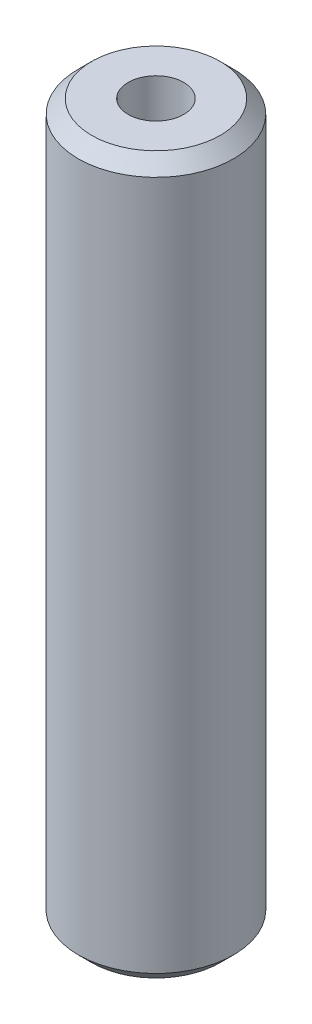
ISO-10303-21;
HEADER;
FILE_DESCRIPTION(('STEP AP214'),'2;1');
FILE_NAME('part.step','',(''),(''),'','','');
FILE_SCHEMA(('AUTOMOTIVE_DESIGN { 1 0 10303 214 1 1 1 1 }'));
ENDSEC;
DATA;
#1=APPLICATION_CONTEXT('core data for automotive mechanical design processes');
#2=APPLICATION_PROTOCOL_DEFINITION('international standard','automotive_design',2000,#1);
#3=PRODUCT_CONTEXT('',#1,'mechanical');
#4=PRODUCT('Part','Part','',(#3));
#5=PRODUCT_RELATED_PRODUCT_CATEGORY('part','',(#4));
#6=PRODUCT_DEFINITION_FORMATION('','',#4);
#7=PRODUCT_DEFINITION_CONTEXT('part definition',#1,'design');
#8=PRODUCT_DEFINITION('design','',#6,#7);
#9=PRODUCT_DEFINITION_SHAPE('','',#8);
#10=(LENGTH_UNIT() NAMED_UNIT(*) SI_UNIT(.MILLI.,.METRE.));
#11=(NAMED_UNIT(*) PLANE_ANGLE_UNIT() SI_UNIT($,.RADIAN.));
#12=(NAMED_UNIT(*) SI_UNIT($,.STERADIAN.) SOLID_ANGLE_UNIT());
#13=UNCERTAINTY_MEASURE_WITH_UNIT(LENGTH_MEASURE(1.E-05),#10,'distance_accuracy_value','');
#14=(GEOMETRIC_REPRESENTATION_CONTEXT(3) GLOBAL_UNCERTAINTY_ASSIGNED_CONTEXT((#13)) GLOBAL_UNIT_ASSIGNED_CONTEXT((#10,
#11,#12)) REPRESENTATION_CONTEXT('',''));
#15=CARTESIAN_POINT('',(0.,0.,0.));
#16=DIRECTION('',(0.,0.,1.));
#17=DIRECTION('',(1.,0.,0.));
#18=AXIS2_PLACEMENT_3D('',#15,#16,#17);
#19=CARTESIAN_POINT('',(0.,253.677838348339,0.));
#20=DIRECTION('',(0.,-1.,0.));
#21=DIRECTION('',(0.,0.,-1.));
#22=AXIS2_PLACEMENT_3D('',#19,#20,#21);
#23=CYLINDRICAL_SURFACE('',#22,27.5);
#24=CARTESIAN_POINT('',(0.,248.90648446959,0.));
#25=DIRECTION('',(0.,1.,0.));
#26=DIRECTION('',(0.,0.,1.));
#27=AXIS2_PLACEMENT_3D('',#24,#25,#26);
#28=CIRCLE('',#27,27.5);
#29=CARTESIAN_POINT('',(0.,248.90648446959,27.5));
#30=VERTEX_POINT('',#29);
#31=EDGE_CURVE('E50',#30,#30,#28,.F.);
#32=ORIENTED_EDGE('',*,*,#31,.T.);
#33=EDGE_LOOP('',(#32));
#34=FACE_BOUND('',#33,.T.);
#35=CARTESIAN_POINT('',(0.,4.77135387874888,0.));
#36=DIRECTION('',(0.,1.,0.));
#37=DIRECTION('',(0.,0.,1.));
#38=AXIS2_PLACEMENT_3D('',#35,#36,#37);
#39=CIRCLE('',#38,27.5);
#40=CARTESIAN_POINT('',(0.,4.77135387874888,27.5));
#41=VERTEX_POINT('',#40);
#42=EDGE_CURVE('E51',#41,#41,#39,.T.);
#43=ORIENTED_EDGE('',*,*,#42,.T.);
#44=EDGE_LOOP('',(#43));
#45=FACE_BOUND('',#44,.T.);
#46=ADVANCED_FACE('F39',(#34,#45),#23,.T.);
#47=CARTESIAN_POINT('',(0.,253.677838348339,0.));
#48=DIRECTION('',(0.,1.,0.));
#49=DIRECTION('',(0.,0.,1.));
#50=AXIS2_PLACEMENT_3D('',#47,#48,#49);
#51=PLANE('',#50);
#52=CARTESIAN_POINT('',(0.,253.677838348339,0.));
#53=DIRECTION('',(0.,1.,0.));
#54=DIRECTION('',(0.,0.,1.));
#55=AXIS2_PLACEMENT_3D('',#52,#53,#54);
#56=CIRCLE('',#55,22.7286461212512);
#57=CARTESIAN_POINT('',(0.,253.677838348339,22.7286461212512));
#58=VERTEX_POINT('',#57);
#59=EDGE_CURVE('E54',#58,#58,#56,.T.);
#60=ORIENTED_EDGE('',*,*,#59,.T.);
#61=EDGE_LOOP('',(#60));
#62=FACE_BOUND('',#61,.T.);
#63=CARTESIAN_POINT('',(0.,253.677838348339,0.));
#64=DIRECTION('',(0.,1.,0.));
#65=DIRECTION('',(0.,0.,1.));
#66=AXIS2_PLACEMENT_3D('',#63,#64,#65);
#67=CIRCLE('',#66,9.83911607770493);
#68=CARTESIAN_POINT('',(0.,253.677838348339,9.83911607770493));
#69=VERTEX_POINT('',#68);
#70=EDGE_CURVE('E58',#69,#69,#67,.T.);
#71=ORIENTED_EDGE('',*,*,#70,.F.);
#72=EDGE_LOOP('',(#71));
#73=FACE_BOUND('',#72,.T.);
#74=ADVANCED_FACE('F69',(#62,#73),#51,.T.);
#75=CARTESIAN_POINT('',(0.,0.,0.));
#76=DIRECTION('',(0.,1.,0.));
#77=DIRECTION('',(0.,0.,1.));
#78=AXIS2_PLACEMENT_3D('',#75,#76,#77);
#79=PLANE('',#78);
#80=CARTESIAN_POINT('',(0.,0.,0.));
#81=DIRECTION('',(0.,1.,0.));
#82=DIRECTION('',(0.,0.,1.));
#83=AXIS2_PLACEMENT_3D('',#80,#81,#82);
#84=CIRCLE('',#83,22.7286461212511);
#85=CARTESIAN_POINT('',(0.,0.,22.7286461212511));
#86=VERTEX_POINT('',#85);
#87=EDGE_CURVE('E10',#86,#86,#84,.F.);
#88=ORIENTED_EDGE('',*,*,#87,.T.);
#89=EDGE_LOOP('',(#88));
#90=FACE_BOUND('',#89,.T.);
#91=CARTESIAN_POINT('',(0.,0.,0.));
#92=DIRECTION('',(0.,1.,0.));
#93=DIRECTION('',(0.,0.,1.));
#94=AXIS2_PLACEMENT_3D('',#91,#92,#93);
#95=CIRCLE('',#94,9.83911607770493);
#96=CARTESIAN_POINT('',(0.,0.,9.83911607770493));
#97=VERTEX_POINT('',#96);
#98=EDGE_CURVE('E63',#97,#97,#95,.T.);
#99=ORIENTED_EDGE('',*,*,#98,.T.);
#100=EDGE_LOOP('',(#99));
#101=FACE_BOUND('',#100,.T.);
#102=ADVANCED_FACE('F75',(#90,#101),#79,.F.);
#103=CARTESIAN_POINT('',(0.,253.677838348339,0.));
#104=DIRECTION('',(0.,-1.,0.));
#105=DIRECTION('',(0.,0.,-1.));
#106=AXIS2_PLACEMENT_3D('',#103,#104,#105);
#107=CYLINDRICAL_SURFACE('',#106,9.83911607770493);
#108=ORIENTED_EDGE('',*,*,#70,.T.);
#109=EDGE_LOOP('',(#108));
#110=FACE_BOUND('',#109,.T.);
#111=ORIENTED_EDGE('',*,*,#98,.F.);
#112=EDGE_LOOP('',(#111));
#113=FACE_BOUND('',#112,.T.);
#114=ADVANCED_FACE('F70',(#110,#113),#107,.F.);
#115=CARTESIAN_POINT('',(0.,253.677838348339,0.));
#116=DIRECTION('',(0.,-1.,0.));
#117=DIRECTION('',(0.,0.,-1.));
#118=AXIS2_PLACEMENT_3D('',#115,#116,#117);
#119=CONICAL_SURFACE('',#118,22.7286461212512,0.785398163397449);
#120=ORIENTED_EDGE('',*,*,#31,.F.);
#121=EDGE_LOOP('',(#120));
#122=FACE_BOUND('',#121,.T.);
#123=ORIENTED_EDGE('',*,*,#59,.F.);
#124=EDGE_LOOP('',(#123));
#125=FACE_BOUND('',#124,.T.);
#126=ADVANCED_FACE('F81',(#122,#125),#119,.T.);
#127=CARTESIAN_POINT('',(0.,4.77135387874888,0.));
#128=DIRECTION('',(0.,1.,0.));
#129=DIRECTION('',(0.,0.,1.));
#130=AXIS2_PLACEMENT_3D('',#127,#128,#129);
#131=CONICAL_SURFACE('',#130,27.5,0.785398163397452);
#132=ORIENTED_EDGE('',*,*,#87,.F.);
#133=EDGE_LOOP('',(#132));
#134=FACE_BOUND('',#133,.T.);
#135=ORIENTED_EDGE('',*,*,#42,.F.);
#136=EDGE_LOOP('',(#135));
#137=FACE_BOUND('',#136,.T.);
#138=ADVANCED_FACE('F45',(#134,#137),#131,.T.);
#139=CLOSED_SHELL('',(#46,#74,#102,#114,#126,#138));
#140=MANIFOLD_SOLID_BREP('B2',#139);
#141=ADVANCED_BREP_SHAPE_REPRESENTATION('',(#18,#140),#14);
#142=SHAPE_DEFINITION_REPRESENTATION(#9,#141);
ENDSEC;
END-ISO-10303-21;
